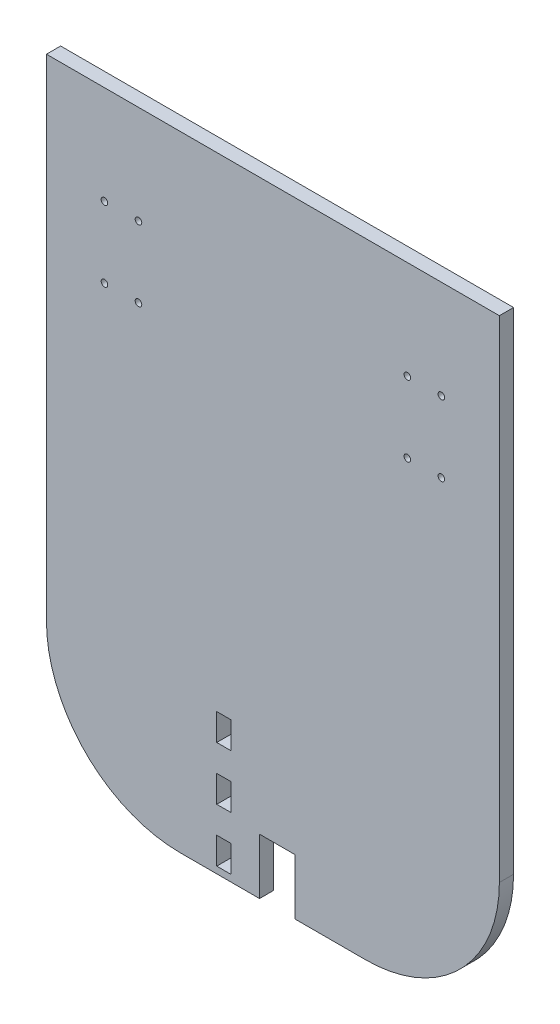
ISO-10303-21;
HEADER;
FILE_DESCRIPTION(('STEP AP214'),'2;1');
FILE_NAME('part.step','',(''),(''),'','','');
FILE_SCHEMA(('AUTOMOTIVE_DESIGN { 1 0 10303 214 1 1 1 1 }'));
ENDSEC;
DATA;
#1=APPLICATION_CONTEXT('core data for automotive mechanical design processes');
#2=APPLICATION_PROTOCOL_DEFINITION('international standard','automotive_design',2000,#1);
#3=PRODUCT_CONTEXT('',#1,'mechanical');
#4=PRODUCT('Part','Part','',(#3));
#5=PRODUCT_RELATED_PRODUCT_CATEGORY('part','',(#4));
#6=PRODUCT_DEFINITION_FORMATION('','',#4);
#7=PRODUCT_DEFINITION_CONTEXT('part definition',#1,'design');
#8=PRODUCT_DEFINITION('design','',#6,#7);
#9=PRODUCT_DEFINITION_SHAPE('','',#8);
#10=(LENGTH_UNIT() NAMED_UNIT(*) SI_UNIT(.MILLI.,.METRE.));
#11=(NAMED_UNIT(*) PLANE_ANGLE_UNIT() SI_UNIT($,.RADIAN.));
#12=(NAMED_UNIT(*) SI_UNIT($,.STERADIAN.) SOLID_ANGLE_UNIT());
#13=UNCERTAINTY_MEASURE_WITH_UNIT(LENGTH_MEASURE(1.E-05),#10,'distance_accuracy_value','');
#14=(GEOMETRIC_REPRESENTATION_CONTEXT(3) GLOBAL_UNCERTAINTY_ASSIGNED_CONTEXT((#13)) GLOBAL_UNIT_ASSIGNED_CONTEXT((#10,
#11,#12)) REPRESENTATION_CONTEXT('',''));
#15=CARTESIAN_POINT('',(0.,0.,0.));
#16=DIRECTION('',(0.,0.,1.));
#17=DIRECTION('',(1.,0.,0.));
#18=AXIS2_PLACEMENT_3D('',#15,#16,#17);
#19=CARTESIAN_POINT('',(-101.5,-140.,6.35));
#20=DIRECTION('',(0.,1.,0.));
#21=DIRECTION('',(0.,0.,1.));
#22=AXIS2_PLACEMENT_3D('',#19,#20,#21);
#23=PLANE('',#22);
#24=DIRECTION('',(1.,0.,0.));
#25=VECTOR('',#24,1.);
#26=CARTESIAN_POINT('',(-101.5,-140.,6.35));
#27=LINE('',#26,#25);
#28=CARTESIAN_POINT('',(-41.5,-140.,6.35));
#29=VERTEX_POINT('',#28);
#30=CARTESIAN_POINT('',(-5.99999999999998,-140.,6.35));
#31=VERTEX_POINT('',#30);
#32=EDGE_CURVE('E388',#29,#31,#27,.T.);
#33=ORIENTED_EDGE('',*,*,#32,.F.);
#34=DIRECTION('',(0.,0.,-1.));
#35=VECTOR('',#34,1.);
#36=CARTESIAN_POINT('',(-41.5,-140.,6.35));
#37=LINE('',#36,#35);
#38=CARTESIAN_POINT('',(-41.5,-140.,0.));
#39=VERTEX_POINT('',#38);
#40=EDGE_CURVE('E46',#29,#39,#37,.T.);
#41=ORIENTED_EDGE('',*,*,#40,.T.);
#42=DIRECTION('',(1.,0.,0.));
#43=VECTOR('',#42,1.);
#44=CARTESIAN_POINT('',(-101.5,-140.,0.));
#45=LINE('',#44,#43);
#46=CARTESIAN_POINT('',(-5.99999999999998,-140.,0.));
#47=VERTEX_POINT('',#46);
#48=EDGE_CURVE('E375',#39,#47,#45,.T.);
#49=ORIENTED_EDGE('',*,*,#48,.T.);
#50=DIRECTION('',(0.,0.,1.));
#51=VECTOR('',#50,1.);
#52=CARTESIAN_POINT('',(-5.99999999999998,-140.,-29.6816441593117));
#53=LINE('',#52,#51);
#54=EDGE_CURVE('E194',#47,#31,#53,.T.);
#55=ORIENTED_EDGE('',*,*,#54,.T.);
#56=EDGE_LOOP('',(#33,#41,#49,#55));
#57=FACE_BOUND('',#56,.T.);
#58=ADVANCED_FACE('F38',(#57),#23,.F.);
#59=CARTESIAN_POINT('',(101.5,-140.,6.35));
#60=DIRECTION('',(-1.,0.,0.));
#61=DIRECTION('',(0.,0.,1.));
#62=AXIS2_PLACEMENT_3D('',#59,#60,#61);
#63=PLANE('',#62);
#64=DIRECTION('',(0.,1.,0.));
#65=VECTOR('',#64,1.);
#66=CARTESIAN_POINT('',(101.5,-140.,6.35));
#67=LINE('',#66,#65);
#68=CARTESIAN_POINT('',(101.5,-80.,6.35));
#69=VERTEX_POINT('',#68);
#70=CARTESIAN_POINT('',(101.5,140.,6.35));
#71=VERTEX_POINT('',#70);
#72=EDGE_CURVE('E370',#69,#71,#67,.T.);
#73=ORIENTED_EDGE('',*,*,#72,.F.);
#74=DIRECTION('',(0.,0.,-1.));
#75=VECTOR('',#74,1.);
#76=CARTESIAN_POINT('',(101.5,-80.,6.35));
#77=LINE('',#76,#75);
#78=CARTESIAN_POINT('',(101.5,-80.,0.));
#79=VERTEX_POINT('',#78);
#80=EDGE_CURVE('E406',#69,#79,#77,.T.);
#81=ORIENTED_EDGE('',*,*,#80,.T.);
#82=DIRECTION('',(0.,1.,0.));
#83=VECTOR('',#82,1.);
#84=CARTESIAN_POINT('',(101.5,-140.,0.));
#85=LINE('',#84,#83);
#86=CARTESIAN_POINT('',(101.5,140.,0.));
#87=VERTEX_POINT('',#86);
#88=EDGE_CURVE('E369',#79,#87,#85,.T.);
#89=ORIENTED_EDGE('',*,*,#88,.T.);
#90=DIRECTION('',(0.,0.,-1.));
#91=VECTOR('',#90,1.);
#92=CARTESIAN_POINT('',(101.5,140.,6.35));
#93=LINE('',#92,#91);
#94=EDGE_CURVE('E403',#71,#87,#93,.T.);
#95=ORIENTED_EDGE('',*,*,#94,.F.);
#96=EDGE_LOOP('',(#73,#81,#89,#95));
#97=FACE_BOUND('',#96,.T.);
#98=ADVANCED_FACE('F435',(#97),#63,.F.);
#99=CARTESIAN_POINT('',(-101.5,140.,6.35));
#100=DIRECTION('',(0.,-1.,0.));
#101=DIRECTION('',(0.,0.,-1.));
#102=AXIS2_PLACEMENT_3D('',#99,#100,#101);
#103=PLANE('',#102);
#104=DIRECTION('',(-1.,0.,0.));
#105=VECTOR('',#104,1.);
#106=CARTESIAN_POINT('',(-101.5,140.,0.));
#107=LINE('',#106,#105);
#108=CARTESIAN_POINT('',(-101.5,140.,0.));
#109=VERTEX_POINT('',#108);
#110=EDGE_CURVE('E395',#87,#109,#107,.T.);
#111=ORIENTED_EDGE('',*,*,#110,.T.);
#112=DIRECTION('',(0.,0.,-1.));
#113=VECTOR('',#112,1.);
#114=CARTESIAN_POINT('',(-101.5,140.,6.35));
#115=LINE('',#114,#113);
#116=CARTESIAN_POINT('',(-101.5,140.,6.35));
#117=VERTEX_POINT('',#116);
#118=EDGE_CURVE('E392',#117,#109,#115,.T.);
#119=ORIENTED_EDGE('',*,*,#118,.F.);
#120=DIRECTION('',(-1.,0.,0.));
#121=VECTOR('',#120,1.);
#122=CARTESIAN_POINT('',(-101.5,140.,6.35));
#123=LINE('',#122,#121);
#124=EDGE_CURVE('E374',#71,#117,#123,.T.);
#125=ORIENTED_EDGE('',*,*,#124,.F.);
#126=ORIENTED_EDGE('',*,*,#94,.T.);
#127=EDGE_LOOP('',(#111,#119,#125,#126));
#128=FACE_BOUND('',#127,.T.);
#129=ADVANCED_FACE('F441',(#128),#103,.F.);
#130=CARTESIAN_POINT('',(-101.5,-140.,6.35));
#131=DIRECTION('',(1.,0.,0.));
#132=DIRECTION('',(0.,0.,-1.));
#133=AXIS2_PLACEMENT_3D('',#130,#131,#132);
#134=PLANE('',#133);
#135=DIRECTION('',(0.,-1.,0.));
#136=VECTOR('',#135,1.);
#137=CARTESIAN_POINT('',(-101.5,-140.,0.));
#138=LINE('',#137,#136);
#139=CARTESIAN_POINT('',(-101.5,-80.,0.));
#140=VERTEX_POINT('',#139);
#141=EDGE_CURVE('E397',#109,#140,#138,.T.);
#142=ORIENTED_EDGE('',*,*,#141,.T.);
#143=DIRECTION('',(0.,0.,-1.));
#144=VECTOR('',#143,1.);
#145=CARTESIAN_POINT('',(-101.5,-80.,6.35));
#146=LINE('',#145,#144);
#147=CARTESIAN_POINT('',(-101.5,-80.,6.35));
#148=VERTEX_POINT('',#147);
#149=EDGE_CURVE('E12',#140,#148,#146,.F.);
#150=ORIENTED_EDGE('',*,*,#149,.T.);
#151=DIRECTION('',(0.,-1.,0.));
#152=VECTOR('',#151,1.);
#153=CARTESIAN_POINT('',(-101.5,-140.,6.35));
#154=LINE('',#153,#152);
#155=EDGE_CURVE('E384',#117,#148,#154,.T.);
#156=ORIENTED_EDGE('',*,*,#155,.F.);
#157=ORIENTED_EDGE('',*,*,#118,.T.);
#158=EDGE_LOOP('',(#142,#150,#156,#157));
#159=FACE_BOUND('',#158,.T.);
#160=ADVANCED_FACE('F425',(#159),#134,.F.);
#161=CARTESIAN_POINT('',(10.,-140.,0.));
#162=VERTEX_POINT('',#161);
#163=CARTESIAN_POINT('',(41.5,-140.,0.));
#164=VERTEX_POINT('',#163);
#165=EDGE_CURVE('E399',#162,#164,#45,.T.);
#166=ORIENTED_EDGE('',*,*,#165,.T.);
#167=DIRECTION('',(0.,0.,-1.));
#168=VECTOR('',#167,1.);
#169=CARTESIAN_POINT('',(41.5,-140.,6.35));
#170=LINE('',#169,#168);
#171=CARTESIAN_POINT('',(41.5,-140.,6.35));
#172=VERTEX_POINT('',#171);
#173=EDGE_CURVE('E413',#164,#172,#170,.F.);
#174=ORIENTED_EDGE('',*,*,#173,.T.);
#175=CARTESIAN_POINT('',(10.,-140.,6.35));
#176=VERTEX_POINT('',#175);
#177=EDGE_CURVE('E387',#176,#172,#27,.T.);
#178=ORIENTED_EDGE('',*,*,#177,.F.);
#179=DIRECTION('',(0.,0.,1.));
#180=VECTOR('',#179,1.);
#181=CARTESIAN_POINT('',(10.,-140.,-29.6816441593117));
#182=LINE('',#181,#180);
#183=EDGE_CURVE('E222',#162,#176,#182,.T.);
#184=ORIENTED_EDGE('',*,*,#183,.F.);
#185=EDGE_LOOP('',(#166,#174,#178,#184));
#186=FACE_BOUND('',#185,.T.);
#187=ADVANCED_FACE('F437',(#186),#23,.F.);
#188=CARTESIAN_POINT('',(101.5,140.,6.35));
#189=DIRECTION('',(0.,0.,-1.));
#190=DIRECTION('',(-1.,0.,0.));
#191=AXIS2_PLACEMENT_3D('',#188,#189,#190);
#192=PLANE('',#191);
#193=DIRECTION('',(0.,-1.,0.));
#194=VECTOR('',#193,1.);
#195=CARTESIAN_POINT('',(-25.175,-77.,6.35));
#196=LINE('',#195,#194);
#197=CARTESIAN_POINT('',(-25.175,-77.,6.35));
#198=VERTEX_POINT('',#197);
#199=CARTESIAN_POINT('',(-25.175,-89.,6.35));
#200=VERTEX_POINT('',#199);
#201=EDGE_CURVE('E233',#198,#200,#196,.T.);
#202=ORIENTED_EDGE('',*,*,#201,.F.);
#203=DIRECTION('',(-1.,0.,0.));
#204=VECTOR('',#203,1.);
#205=CARTESIAN_POINT('',(-25.175,-77.,6.35));
#206=LINE('',#205,#204);
#207=CARTESIAN_POINT('',(-18.825,-77.,6.35));
#208=VERTEX_POINT('',#207);
#209=EDGE_CURVE('E478',#208,#198,#206,.T.);
#210=ORIENTED_EDGE('',*,*,#209,.F.);
#211=DIRECTION('',(0.,1.,0.));
#212=VECTOR('',#211,1.);
#213=CARTESIAN_POINT('',(-18.825,-77.,6.35));
#214=LINE('',#213,#212);
#215=CARTESIAN_POINT('',(-18.825,-89.,6.35));
#216=VERTEX_POINT('',#215);
#217=EDGE_CURVE('E227',#216,#208,#214,.T.);
#218=ORIENTED_EDGE('',*,*,#217,.F.);
#219=DIRECTION('',(1.,0.,0.));
#220=VECTOR('',#219,1.);
#221=CARTESIAN_POINT('',(-25.175,-89.,6.35));
#222=LINE('',#221,#220);
#223=EDGE_CURVE('E228',#200,#216,#222,.T.);
#224=ORIENTED_EDGE('',*,*,#223,.F.);
#225=EDGE_LOOP('',(#202,#210,#218,#224));
#226=FACE_BOUND('',#225,.T.);
#227=DIRECTION('',(0.,-1.,0.));
#228=VECTOR('',#227,1.);
#229=CARTESIAN_POINT('',(-25.175,-101.,6.35));
#230=LINE('',#229,#228);
#231=CARTESIAN_POINT('',(-25.175,-101.,6.35));
#232=VERTEX_POINT('',#231);
#233=CARTESIAN_POINT('',(-25.175,-113.,6.35));
#234=VERTEX_POINT('',#233);
#235=EDGE_CURVE('E245',#232,#234,#230,.T.);
#236=ORIENTED_EDGE('',*,*,#235,.F.);
#237=DIRECTION('',(-1.,0.,0.));
#238=VECTOR('',#237,1.);
#239=CARTESIAN_POINT('',(-25.175,-101.,6.35));
#240=LINE('',#239,#238);
#241=CARTESIAN_POINT('',(-18.825,-101.,6.35));
#242=VERTEX_POINT('',#241);
#243=EDGE_CURVE('E251',#242,#232,#240,.T.);
#244=ORIENTED_EDGE('',*,*,#243,.F.);
#245=DIRECTION('',(0.,1.,0.));
#246=VECTOR('',#245,1.);
#247=CARTESIAN_POINT('',(-18.825,-101.,6.35));
#248=LINE('',#247,#246);
#249=CARTESIAN_POINT('',(-18.825,-113.,6.35));
#250=VERTEX_POINT('',#249);
#251=EDGE_CURVE('E258',#250,#242,#248,.T.);
#252=ORIENTED_EDGE('',*,*,#251,.F.);
#253=DIRECTION('',(1.,0.,0.));
#254=VECTOR('',#253,1.);
#255=CARTESIAN_POINT('',(-25.175,-113.,6.35));
#256=LINE('',#255,#254);
#257=EDGE_CURVE('E250',#234,#250,#256,.T.);
#258=ORIENTED_EDGE('',*,*,#257,.F.);
#259=EDGE_LOOP('',(#236,#244,#252,#258));
#260=FACE_BOUND('',#259,.T.);
#261=DIRECTION('',(0.,1.,0.));
#262=VECTOR('',#261,1.);
#263=CARTESIAN_POINT('',(-18.825,-125.,6.35));
#264=LINE('',#263,#262);
#265=CARTESIAN_POINT('',(-18.825,-137.,6.35));
#266=VERTEX_POINT('',#265);
#267=CARTESIAN_POINT('',(-18.825,-125.,6.35));
#268=VERTEX_POINT('',#267);
#269=EDGE_CURVE('E272',#266,#268,#264,.T.);
#270=ORIENTED_EDGE('',*,*,#269,.F.);
#271=DIRECTION('',(1.,0.,0.));
#272=VECTOR('',#271,1.);
#273=CARTESIAN_POINT('',(-18.825,-137.,6.35));
#274=LINE('',#273,#272);
#275=CARTESIAN_POINT('',(-25.175,-137.,6.35));
#276=VERTEX_POINT('',#275);
#277=EDGE_CURVE('E278',#276,#266,#274,.T.);
#278=ORIENTED_EDGE('',*,*,#277,.F.);
#279=DIRECTION('',(0.,-1.,0.));
#280=VECTOR('',#279,1.);
#281=CARTESIAN_POINT('',(-25.175,-125.,6.35));
#282=LINE('',#281,#280);
#283=CARTESIAN_POINT('',(-25.175,-125.,6.35));
#284=VERTEX_POINT('',#283);
#285=EDGE_CURVE('E285',#284,#276,#282,.T.);
#286=ORIENTED_EDGE('',*,*,#285,.F.);
#287=DIRECTION('',(-1.,0.,0.));
#288=VECTOR('',#287,1.);
#289=CARTESIAN_POINT('',(-18.825,-125.,6.35));
#290=LINE('',#289,#288);
#291=EDGE_CURVE('E277',#268,#284,#290,.T.);
#292=ORIENTED_EDGE('',*,*,#291,.F.);
#293=EDGE_LOOP('',(#270,#278,#286,#292));
#294=FACE_BOUND('',#293,.T.);
#295=CARTESIAN_POINT('',(-60.26,95.875,6.35));
#296=DIRECTION('',(0.,0.,1.));
#297=DIRECTION('',(-1.,0.,0.));
#298=AXIS2_PLACEMENT_3D('',#295,#296,#297);
#299=CIRCLE('',#298,1.475);
#300=CARTESIAN_POINT('',(-61.735,95.875,6.35));
#301=VERTEX_POINT('',#300);
#302=EDGE_CURVE('E299',#301,#301,#299,.T.);
#303=ORIENTED_EDGE('',*,*,#302,.F.);
#304=EDGE_LOOP('',(#303));
#305=FACE_BOUND('',#304,.T.);
#306=CARTESIAN_POINT('',(-75.5,95.875,6.35));
#307=DIRECTION('',(0.,0.,1.));
#308=DIRECTION('',(-1.,0.,0.));
#309=AXIS2_PLACEMENT_3D('',#306,#307,#308);
#310=CIRCLE('',#309,1.475);
#311=CARTESIAN_POINT('',(-76.975,95.875,6.35));
#312=VERTEX_POINT('',#311);
#313=EDGE_CURVE('E309',#312,#312,#310,.T.);
#314=ORIENTED_EDGE('',*,*,#313,.F.);
#315=EDGE_LOOP('',(#314));
#316=FACE_BOUND('',#315,.T.);
#317=CARTESIAN_POINT('',(-60.26,64.125,6.35));
#318=DIRECTION('',(0.,0.,1.));
#319=DIRECTION('',(-1.,0.,0.));
#320=AXIS2_PLACEMENT_3D('',#317,#318,#319);
#321=CIRCLE('',#320,1.475);
#322=CARTESIAN_POINT('',(-61.735,64.125,6.35));
#323=VERTEX_POINT('',#322);
#324=EDGE_CURVE('E317',#323,#323,#321,.T.);
#325=ORIENTED_EDGE('',*,*,#324,.F.);
#326=EDGE_LOOP('',(#325));
#327=FACE_BOUND('',#326,.T.);
#328=CARTESIAN_POINT('',(-75.5,64.125,6.35));
#329=DIRECTION('',(0.,0.,1.));
#330=DIRECTION('',(-1.,0.,0.));
#331=AXIS2_PLACEMENT_3D('',#328,#329,#330);
#332=CIRCLE('',#331,1.475);
#333=CARTESIAN_POINT('',(-76.975,64.125,6.35));
#334=VERTEX_POINT('',#333);
#335=EDGE_CURVE('E328',#334,#334,#332,.T.);
#336=ORIENTED_EDGE('',*,*,#335,.F.);
#337=EDGE_LOOP('',(#336));
#338=FACE_BOUND('',#337,.T.);
#339=CARTESIAN_POINT('',(75.5,64.125,6.35));
#340=DIRECTION('',(0.,0.,1.));
#341=DIRECTION('',(1.,0.,0.));
#342=AXIS2_PLACEMENT_3D('',#339,#340,#341);
#343=CIRCLE('',#342,1.475);
#344=CARTESIAN_POINT('',(76.975,64.125,6.35));
#345=VERTEX_POINT('',#344);
#346=EDGE_CURVE('E335',#345,#345,#343,.T.);
#347=ORIENTED_EDGE('',*,*,#346,.F.);
#348=EDGE_LOOP('',(#347));
#349=FACE_BOUND('',#348,.T.);
#350=CARTESIAN_POINT('',(60.26,64.125,6.35));
#351=DIRECTION('',(0.,0.,1.));
#352=DIRECTION('',(1.,0.,0.));
#353=AXIS2_PLACEMENT_3D('',#350,#351,#352);
#354=CIRCLE('',#353,1.475);
#355=CARTESIAN_POINT('',(61.735,64.125,6.35));
#356=VERTEX_POINT('',#355);
#357=EDGE_CURVE('E343',#356,#356,#354,.T.);
#358=ORIENTED_EDGE('',*,*,#357,.F.);
#359=EDGE_LOOP('',(#358));
#360=FACE_BOUND('',#359,.T.);
#361=CARTESIAN_POINT('',(75.5,95.875,6.35));
#362=DIRECTION('',(0.,0.,1.));
#363=DIRECTION('',(1.,0.,0.));
#364=AXIS2_PLACEMENT_3D('',#361,#362,#363);
#365=CIRCLE('',#364,1.475);
#366=CARTESIAN_POINT('',(76.975,95.875,6.35));
#367=VERTEX_POINT('',#366);
#368=EDGE_CURVE('E354',#367,#367,#365,.T.);
#369=ORIENTED_EDGE('',*,*,#368,.F.);
#370=EDGE_LOOP('',(#369));
#371=FACE_BOUND('',#370,.T.);
#372=CARTESIAN_POINT('',(60.26,95.875,6.35));
#373=DIRECTION('',(0.,0.,1.));
#374=DIRECTION('',(1.,0.,0.));
#375=AXIS2_PLACEMENT_3D('',#372,#373,#374);
#376=CIRCLE('',#375,1.475);
#377=CARTESIAN_POINT('',(61.735,95.875,6.35));
#378=VERTEX_POINT('',#377);
#379=EDGE_CURVE('E361',#378,#378,#376,.T.);
#380=ORIENTED_EDGE('',*,*,#379,.F.);
#381=EDGE_LOOP('',(#380));
#382=FACE_BOUND('',#381,.T.);
#383=ORIENTED_EDGE('',*,*,#177,.T.);
#384=CARTESIAN_POINT('',(41.5,-80.,6.35));
#385=DIRECTION('',(0.,0.,-1.));
#386=DIRECTION('',(-1.,0.,0.));
#387=AXIS2_PLACEMENT_3D('',#384,#385,#386);
#388=CIRCLE('',#387,60.);
#389=EDGE_CURVE('E417',#172,#69,#388,.F.);
#390=ORIENTED_EDGE('',*,*,#389,.T.);
#391=ORIENTED_EDGE('',*,*,#72,.T.);
#392=ORIENTED_EDGE('',*,*,#124,.T.);
#393=ORIENTED_EDGE('',*,*,#155,.T.);
#394=CARTESIAN_POINT('',(-41.5,-80.,6.35));
#395=DIRECTION('',(0.,0.,-1.));
#396=DIRECTION('',(-1.,0.,0.));
#397=AXIS2_PLACEMENT_3D('',#394,#395,#396);
#398=CIRCLE('',#397,60.);
#399=EDGE_CURVE('E58',#148,#29,#398,.F.);
#400=ORIENTED_EDGE('',*,*,#399,.T.);
#401=ORIENTED_EDGE('',*,*,#32,.T.);
#402=DIRECTION('',(0.,-1.,0.));
#403=VECTOR('',#402,1.);
#404=CARTESIAN_POINT('',(-5.99999999999999,-115.,6.35));
#405=LINE('',#404,#403);
#406=CARTESIAN_POINT('',(-5.99999999999999,-115.,6.35));
#407=VERTEX_POINT('',#406);
#408=EDGE_CURVE('E213',#407,#31,#405,.T.);
#409=ORIENTED_EDGE('',*,*,#408,.F.);
#410=DIRECTION('',(-1.,0.,0.));
#411=VECTOR('',#410,1.);
#412=CARTESIAN_POINT('',(-5.99999999999999,-115.,6.35));
#413=LINE('',#412,#411);
#414=CARTESIAN_POINT('',(10.,-115.,6.35));
#415=VERTEX_POINT('',#414);
#416=EDGE_CURVE('E205',#415,#407,#413,.T.);
#417=ORIENTED_EDGE('',*,*,#416,.F.);
#418=DIRECTION('',(0.,1.,0.));
#419=VECTOR('',#418,1.);
#420=CARTESIAN_POINT('',(10.,-115.,6.35));
#421=LINE('',#420,#419);
#422=EDGE_CURVE('E218',#176,#415,#421,.T.);
#423=ORIENTED_EDGE('',*,*,#422,.F.);
#424=EDGE_LOOP('',(#383,#390,#391,#392,#393,#400,#401,#409,#417,#423));
#425=FACE_BOUND('',#424,.T.);
#426=ADVANCED_FACE('F447',(#226,#260,#294,#305,#316,#327,#338,#349,#360,#371,#382,#425),#192,.F.);
#427=CARTESIAN_POINT('',(101.5,140.,0.));
#428=DIRECTION('',(0.,0.,-1.));
#429=DIRECTION('',(-1.,0.,0.));
#430=AXIS2_PLACEMENT_3D('',#427,#428,#429);
#431=PLANE('',#430);
#432=ORIENTED_EDGE('',*,*,#88,.F.);
#433=CARTESIAN_POINT('',(41.5,-80.,0.));
#434=DIRECTION('',(0.,0.,-1.));
#435=DIRECTION('',(-1.,0.,0.));
#436=AXIS2_PLACEMENT_3D('',#433,#434,#435);
#437=CIRCLE('',#436,60.);
#438=EDGE_CURVE('E411',#79,#164,#437,.T.);
#439=ORIENTED_EDGE('',*,*,#438,.T.);
#440=ORIENTED_EDGE('',*,*,#165,.F.);
#441=DIRECTION('',(0.,1.,0.));
#442=VECTOR('',#441,1.);
#443=CARTESIAN_POINT('',(10.,-115.,0.));
#444=LINE('',#443,#442);
#445=CARTESIAN_POINT('',(10.,-115.,0.));
#446=VERTEX_POINT('',#445);
#447=EDGE_CURVE('E212',#162,#446,#444,.T.);
#448=ORIENTED_EDGE('',*,*,#447,.T.);
#449=DIRECTION('',(-1.,0.,0.));
#450=VECTOR('',#449,1.);
#451=CARTESIAN_POINT('',(-5.99999999999999,-115.,0.));
#452=LINE('',#451,#450);
#453=CARTESIAN_POINT('',(-5.99999999999999,-115.,0.));
#454=VERTEX_POINT('',#453);
#455=EDGE_CURVE('E202',#446,#454,#452,.T.);
#456=ORIENTED_EDGE('',*,*,#455,.T.);
#457=DIRECTION('',(0.,-1.,0.));
#458=VECTOR('',#457,1.);
#459=CARTESIAN_POINT('',(-5.99999999999999,-115.,0.));
#460=LINE('',#459,#458);
#461=EDGE_CURVE('E187',#454,#47,#460,.T.);
#462=ORIENTED_EDGE('',*,*,#461,.T.);
#463=ORIENTED_EDGE('',*,*,#48,.F.);
#464=CARTESIAN_POINT('',(-41.5,-80.,0.));
#465=DIRECTION('',(0.,0.,-1.));
#466=DIRECTION('',(-1.,0.,0.));
#467=AXIS2_PLACEMENT_3D('',#464,#465,#466);
#468=CIRCLE('',#467,60.);
#469=EDGE_CURVE('E409',#39,#140,#468,.T.);
#470=ORIENTED_EDGE('',*,*,#469,.T.);
#471=ORIENTED_EDGE('',*,*,#141,.F.);
#472=ORIENTED_EDGE('',*,*,#110,.F.);
#473=EDGE_LOOP('',(#432,#439,#440,#448,#456,#462,#463,#470,#471,#472));
#474=FACE_BOUND('',#473,.T.);
#475=DIRECTION('',(-1.,0.,0.));
#476=VECTOR('',#475,1.);
#477=CARTESIAN_POINT('',(-25.175,-77.,0.));
#478=LINE('',#477,#476);
#479=CARTESIAN_POINT('',(-18.825,-77.,0.));
#480=VERTEX_POINT('',#479);
#481=CARTESIAN_POINT('',(-25.175,-77.,0.));
#482=VERTEX_POINT('',#481);
#483=EDGE_CURVE('E232',#480,#482,#478,.T.);
#484=ORIENTED_EDGE('',*,*,#483,.T.);
#485=DIRECTION('',(0.,-1.,0.));
#486=VECTOR('',#485,1.);
#487=CARTESIAN_POINT('',(-25.175,-77.,0.));
#488=LINE('',#487,#486);
#489=CARTESIAN_POINT('',(-25.175,-89.,0.));
#490=VERTEX_POINT('',#489);
#491=EDGE_CURVE('E510',#482,#490,#488,.T.);
#492=ORIENTED_EDGE('',*,*,#491,.T.);
#493=DIRECTION('',(1.,0.,0.));
#494=VECTOR('',#493,1.);
#495=CARTESIAN_POINT('',(-25.175,-89.,0.));
#496=LINE('',#495,#494);
#497=CARTESIAN_POINT('',(-18.825,-89.,0.));
#498=VERTEX_POINT('',#497);
#499=EDGE_CURVE('E504',#490,#498,#496,.T.);
#500=ORIENTED_EDGE('',*,*,#499,.T.);
#501=DIRECTION('',(0.,1.,0.));
#502=VECTOR('',#501,1.);
#503=CARTESIAN_POINT('',(-18.825,-77.,0.));
#504=LINE('',#503,#502);
#505=EDGE_CURVE('E503',#498,#480,#504,.T.);
#506=ORIENTED_EDGE('',*,*,#505,.T.);
#507=EDGE_LOOP('',(#484,#492,#500,#506));
#508=FACE_BOUND('',#507,.T.);
#509=DIRECTION('',(-1.,0.,0.));
#510=VECTOR('',#509,1.);
#511=CARTESIAN_POINT('',(-25.175,-101.,0.));
#512=LINE('',#511,#510);
#513=CARTESIAN_POINT('',(-18.825,-101.,0.));
#514=VERTEX_POINT('',#513);
#515=CARTESIAN_POINT('',(-25.175,-101.,0.));
#516=VERTEX_POINT('',#515);
#517=EDGE_CURVE('E264',#514,#516,#512,.T.);
#518=ORIENTED_EDGE('',*,*,#517,.T.);
#519=DIRECTION('',(0.,-1.,0.));
#520=VECTOR('',#519,1.);
#521=CARTESIAN_POINT('',(-25.175,-101.,0.));
#522=LINE('',#521,#520);
#523=CARTESIAN_POINT('',(-25.175,-113.,0.));
#524=VERTEX_POINT('',#523);
#525=EDGE_CURVE('E829',#516,#524,#522,.T.);
#526=ORIENTED_EDGE('',*,*,#525,.T.);
#527=DIRECTION('',(1.,0.,0.));
#528=VECTOR('',#527,1.);
#529=CARTESIAN_POINT('',(-25.175,-113.,0.));
#530=LINE('',#529,#528);
#531=CARTESIAN_POINT('',(-18.825,-113.,0.));
#532=VERTEX_POINT('',#531);
#533=EDGE_CURVE('E820',#524,#532,#530,.T.);
#534=ORIENTED_EDGE('',*,*,#533,.T.);
#535=DIRECTION('',(0.,1.,0.));
#536=VECTOR('',#535,1.);
#537=CARTESIAN_POINT('',(-18.825,-101.,0.));
#538=LINE('',#537,#536);
#539=EDGE_CURVE('E818',#532,#514,#538,.T.);
#540=ORIENTED_EDGE('',*,*,#539,.T.);
#541=EDGE_LOOP('',(#518,#526,#534,#540));
#542=FACE_BOUND('',#541,.T.);
#543=DIRECTION('',(1.,0.,0.));
#544=VECTOR('',#543,1.);
#545=CARTESIAN_POINT('',(-18.825,-137.,0.));
#546=LINE('',#545,#544);
#547=CARTESIAN_POINT('',(-25.175,-137.,0.));
#548=VERTEX_POINT('',#547);
#549=CARTESIAN_POINT('',(-18.825,-137.,0.));
#550=VERTEX_POINT('',#549);
#551=EDGE_CURVE('E291',#548,#550,#546,.T.);
#552=ORIENTED_EDGE('',*,*,#551,.T.);
#553=DIRECTION('',(0.,1.,0.));
#554=VECTOR('',#553,1.);
#555=CARTESIAN_POINT('',(-18.825,-125.,0.));
#556=LINE('',#555,#554);
#557=CARTESIAN_POINT('',(-18.825,-125.,0.));
#558=VERTEX_POINT('',#557);
#559=EDGE_CURVE('E865',#550,#558,#556,.T.);
#560=ORIENTED_EDGE('',*,*,#559,.T.);
#561=DIRECTION('',(-1.,0.,0.));
#562=VECTOR('',#561,1.);
#563=CARTESIAN_POINT('',(-18.825,-125.,0.));
#564=LINE('',#563,#562);
#565=CARTESIAN_POINT('',(-25.175,-125.,0.));
#566=VERTEX_POINT('',#565);
#567=EDGE_CURVE('E871',#558,#566,#564,.T.);
#568=ORIENTED_EDGE('',*,*,#567,.T.);
#569=DIRECTION('',(0.,-1.,0.));
#570=VECTOR('',#569,1.);
#571=CARTESIAN_POINT('',(-25.175,-125.,0.));
#572=LINE('',#571,#570);
#573=EDGE_CURVE('E866',#566,#548,#572,.T.);
#574=ORIENTED_EDGE('',*,*,#573,.T.);
#575=EDGE_LOOP('',(#552,#560,#568,#574));
#576=FACE_BOUND('',#575,.T.);
#577=CARTESIAN_POINT('',(-60.26,95.875,0.));
#578=DIRECTION('',(0.,0.,-1.));
#579=DIRECTION('',(-1.,0.,0.));
#580=AXIS2_PLACEMENT_3D('',#577,#578,#579);
#581=CIRCLE('',#580,1.475);
#582=CARTESIAN_POINT('',(-61.735,95.875,0.));
#583=VERTEX_POINT('',#582);
#584=EDGE_CURVE('E305',#583,#583,#581,.F.);
#585=ORIENTED_EDGE('',*,*,#584,.T.);
#586=EDGE_LOOP('',(#585));
#587=FACE_BOUND('',#586,.T.);
#588=CARTESIAN_POINT('',(-75.5,95.875,0.));
#589=DIRECTION('',(0.,0.,-1.));
#590=DIRECTION('',(-1.,0.,0.));
#591=AXIS2_PLACEMENT_3D('',#588,#589,#590);
#592=CIRCLE('',#591,1.475);
#593=CARTESIAN_POINT('',(-76.975,95.875,0.));
#594=VERTEX_POINT('',#593);
#595=EDGE_CURVE('E314',#594,#594,#592,.F.);
#596=ORIENTED_EDGE('',*,*,#595,.T.);
#597=EDGE_LOOP('',(#596));
#598=FACE_BOUND('',#597,.T.);
#599=CARTESIAN_POINT('',(-60.26,64.125,0.));
#600=DIRECTION('',(0.,0.,-1.));
#601=DIRECTION('',(-1.,0.,0.));
#602=AXIS2_PLACEMENT_3D('',#599,#600,#601);
#603=CIRCLE('',#602,1.475);
#604=CARTESIAN_POINT('',(-61.735,64.125,0.));
#605=VERTEX_POINT('',#604);
#606=EDGE_CURVE('E322',#605,#605,#603,.F.);
#607=ORIENTED_EDGE('',*,*,#606,.T.);
#608=EDGE_LOOP('',(#607));
#609=FACE_BOUND('',#608,.T.);
#610=CARTESIAN_POINT('',(-75.5,64.125,0.));
#611=DIRECTION('',(0.,0.,-1.));
#612=DIRECTION('',(-1.,0.,0.));
#613=AXIS2_PLACEMENT_3D('',#610,#611,#612);
#614=CIRCLE('',#613,1.475);
#615=CARTESIAN_POINT('',(-76.975,64.125,0.));
#616=VERTEX_POINT('',#615);
#617=EDGE_CURVE('E333',#616,#616,#614,.F.);
#618=ORIENTED_EDGE('',*,*,#617,.T.);
#619=EDGE_LOOP('',(#618));
#620=FACE_BOUND('',#619,.T.);
#621=CARTESIAN_POINT('',(75.5,64.125,0.));
#622=DIRECTION('',(0.,0.,-1.));
#623=DIRECTION('',(-1.,0.,0.));
#624=AXIS2_PLACEMENT_3D('',#621,#622,#623);
#625=CIRCLE('',#624,1.475);
#626=CARTESIAN_POINT('',(74.025,64.125,0.));
#627=VERTEX_POINT('',#626);
#628=EDGE_CURVE('E340',#627,#627,#625,.F.);
#629=ORIENTED_EDGE('',*,*,#628,.T.);
#630=EDGE_LOOP('',(#629));
#631=FACE_BOUND('',#630,.T.);
#632=CARTESIAN_POINT('',(60.26,64.125,0.));
#633=DIRECTION('',(0.,0.,-1.));
#634=DIRECTION('',(-1.,0.,0.));
#635=AXIS2_PLACEMENT_3D('',#632,#633,#634);
#636=CIRCLE('',#635,1.475);
#637=CARTESIAN_POINT('',(58.785,64.125,0.));
#638=VERTEX_POINT('',#637);
#639=EDGE_CURVE('E348',#638,#638,#636,.F.);
#640=ORIENTED_EDGE('',*,*,#639,.T.);
#641=EDGE_LOOP('',(#640));
#642=FACE_BOUND('',#641,.T.);
#643=CARTESIAN_POINT('',(75.5,95.875,0.));
#644=DIRECTION('',(0.,0.,-1.));
#645=DIRECTION('',(-1.,0.,0.));
#646=AXIS2_PLACEMENT_3D('',#643,#644,#645);
#647=CIRCLE('',#646,1.475);
#648=CARTESIAN_POINT('',(74.025,95.875,0.));
#649=VERTEX_POINT('',#648);
#650=EDGE_CURVE('E359',#649,#649,#647,.F.);
#651=ORIENTED_EDGE('',*,*,#650,.T.);
#652=EDGE_LOOP('',(#651));
#653=FACE_BOUND('',#652,.T.);
#654=CARTESIAN_POINT('',(60.26,95.875,0.));
#655=DIRECTION('',(0.,0.,-1.));
#656=DIRECTION('',(-1.,0.,0.));
#657=AXIS2_PLACEMENT_3D('',#654,#655,#656);
#658=CIRCLE('',#657,1.475);
#659=CARTESIAN_POINT('',(58.785,95.875,0.));
#660=VERTEX_POINT('',#659);
#661=EDGE_CURVE('E366',#660,#660,#658,.F.);
#662=ORIENTED_EDGE('',*,*,#661,.T.);
#663=EDGE_LOOP('',(#662));
#664=FACE_BOUND('',#663,.T.);
#665=ADVANCED_FACE('F209',(#474,#508,#542,#576,#587,#598,#609,#620,#631,#642,#653,#664),#431,.T.);
#666=CARTESIAN_POINT('',(60.26,95.875,-4.17193000900064));
#667=DIRECTION('',(0.,0.,1.));
#668=DIRECTION('',(1.,0.,0.));
#669=AXIS2_PLACEMENT_3D('',#666,#667,#668);
#670=CYLINDRICAL_SURFACE('',#669,1.475);
#671=ORIENTED_EDGE('',*,*,#379,.T.);
#672=EDGE_LOOP('',(#671));
#673=FACE_BOUND('',#672,.T.);
#674=ORIENTED_EDGE('',*,*,#661,.F.);
#675=EDGE_LOOP('',(#674));
#676=FACE_BOUND('',#675,.T.);
#677=ADVANCED_FACE('F519',(#673,#676),#670,.F.);
#678=CARTESIAN_POINT('',(75.5,95.875,-4.17193000900064));
#679=DIRECTION('',(0.,0.,1.));
#680=DIRECTION('',(1.,0.,0.));
#681=AXIS2_PLACEMENT_3D('',#678,#679,#680);
#682=CYLINDRICAL_SURFACE('',#681,1.475);
#683=ORIENTED_EDGE('',*,*,#368,.T.);
#684=EDGE_LOOP('',(#683));
#685=FACE_BOUND('',#684,.T.);
#686=ORIENTED_EDGE('',*,*,#650,.F.);
#687=EDGE_LOOP('',(#686));
#688=FACE_BOUND('',#687,.T.);
#689=ADVANCED_FACE('F549',(#685,#688),#682,.F.);
#690=CARTESIAN_POINT('',(60.26,64.125,-4.17193000900064));
#691=DIRECTION('',(0.,0.,1.));
#692=DIRECTION('',(1.,0.,0.));
#693=AXIS2_PLACEMENT_3D('',#690,#691,#692);
#694=CYLINDRICAL_SURFACE('',#693,1.475);
#695=ORIENTED_EDGE('',*,*,#357,.T.);
#696=EDGE_LOOP('',(#695));
#697=FACE_BOUND('',#696,.T.);
#698=ORIENTED_EDGE('',*,*,#639,.F.);
#699=EDGE_LOOP('',(#698));
#700=FACE_BOUND('',#699,.T.);
#701=ADVANCED_FACE('F555',(#697,#700),#694,.F.);
#702=CARTESIAN_POINT('',(75.5,64.125,-4.17193000900064));
#703=DIRECTION('',(0.,0.,1.));
#704=DIRECTION('',(1.,0.,0.));
#705=AXIS2_PLACEMENT_3D('',#702,#703,#704);
#706=CYLINDRICAL_SURFACE('',#705,1.475);
#707=ORIENTED_EDGE('',*,*,#346,.T.);
#708=EDGE_LOOP('',(#707));
#709=FACE_BOUND('',#708,.T.);
#710=ORIENTED_EDGE('',*,*,#628,.F.);
#711=EDGE_LOOP('',(#710));
#712=FACE_BOUND('',#711,.T.);
#713=ADVANCED_FACE('F561',(#709,#712),#706,.F.);
#714=CARTESIAN_POINT('',(-75.5,64.125,-4.17193000900064));
#715=DIRECTION('',(0.,0.,1.));
#716=DIRECTION('',(1.,0.,0.));
#717=AXIS2_PLACEMENT_3D('',#714,#715,#716);
#718=CYLINDRICAL_SURFACE('',#717,1.475);
#719=ORIENTED_EDGE('',*,*,#335,.T.);
#720=EDGE_LOOP('',(#719));
#721=FACE_BOUND('',#720,.T.);
#722=ORIENTED_EDGE('',*,*,#617,.F.);
#723=EDGE_LOOP('',(#722));
#724=FACE_BOUND('',#723,.T.);
#725=ADVANCED_FACE('F565',(#721,#724),#718,.F.);
#726=CARTESIAN_POINT('',(-60.26,64.125,-4.17193000900064));
#727=DIRECTION('',(0.,0.,1.));
#728=DIRECTION('',(1.,0.,0.));
#729=AXIS2_PLACEMENT_3D('',#726,#727,#728);
#730=CYLINDRICAL_SURFACE('',#729,1.475);
#731=ORIENTED_EDGE('',*,*,#324,.T.);
#732=EDGE_LOOP('',(#731));
#733=FACE_BOUND('',#732,.T.);
#734=ORIENTED_EDGE('',*,*,#606,.F.);
#735=EDGE_LOOP('',(#734));
#736=FACE_BOUND('',#735,.T.);
#737=ADVANCED_FACE('F569',(#733,#736),#730,.F.);
#738=CARTESIAN_POINT('',(-75.5,95.875,-4.17193000900064));
#739=DIRECTION('',(0.,0.,1.));
#740=DIRECTION('',(1.,0.,0.));
#741=AXIS2_PLACEMENT_3D('',#738,#739,#740);
#742=CYLINDRICAL_SURFACE('',#741,1.475);
#743=ORIENTED_EDGE('',*,*,#313,.T.);
#744=EDGE_LOOP('',(#743));
#745=FACE_BOUND('',#744,.T.);
#746=ORIENTED_EDGE('',*,*,#595,.F.);
#747=EDGE_LOOP('',(#746));
#748=FACE_BOUND('',#747,.T.);
#749=ADVANCED_FACE('F573',(#745,#748),#742,.F.);
#750=CARTESIAN_POINT('',(-60.26,95.875,-4.17193000900064));
#751=DIRECTION('',(0.,0.,1.));
#752=DIRECTION('',(1.,0.,0.));
#753=AXIS2_PLACEMENT_3D('',#750,#751,#752);
#754=CYLINDRICAL_SURFACE('',#753,1.475);
#755=ORIENTED_EDGE('',*,*,#302,.T.);
#756=EDGE_LOOP('',(#755));
#757=FACE_BOUND('',#756,.T.);
#758=ORIENTED_EDGE('',*,*,#584,.F.);
#759=EDGE_LOOP('',(#758));
#760=FACE_BOUND('',#759,.T.);
#761=ADVANCED_FACE('F577',(#757,#760),#754,.F.);
#762=CARTESIAN_POINT('',(-18.825,-137.,-29.6816441593117));
#763=DIRECTION('',(0.,-1.,0.));
#764=DIRECTION('',(0.,0.,-1.));
#765=AXIS2_PLACEMENT_3D('',#762,#763,#764);
#766=PLANE('',#765);
#767=DIRECTION('',(0.,0.,1.));
#768=VECTOR('',#767,1.);
#769=CARTESIAN_POINT('',(-25.175,-137.,-29.6816441593117));
#770=LINE('',#769,#768);
#771=EDGE_CURVE('E306',#548,#276,#770,.T.);
#772=ORIENTED_EDGE('',*,*,#771,.T.);
#773=ORIENTED_EDGE('',*,*,#277,.T.);
#774=DIRECTION('',(0.,0.,1.));
#775=VECTOR('',#774,1.);
#776=CARTESIAN_POINT('',(-18.825,-137.,-29.6816441593117));
#777=LINE('',#776,#775);
#778=EDGE_CURVE('E864',#550,#266,#777,.T.);
#779=ORIENTED_EDGE('',*,*,#778,.F.);
#780=ORIENTED_EDGE('',*,*,#551,.F.);
#781=EDGE_LOOP('',(#772,#773,#779,#780));
#782=FACE_BOUND('',#781,.T.);
#783=ADVANCED_FACE('F581',(#782),#766,.F.);
#784=CARTESIAN_POINT('',(-18.825,-125.,-29.6816441593117));
#785=DIRECTION('',(1.,0.,0.));
#786=DIRECTION('',(0.,1.,0.));
#787=AXIS2_PLACEMENT_3D('',#784,#785,#786);
#788=PLANE('',#787);
#789=ORIENTED_EDGE('',*,*,#778,.T.);
#790=ORIENTED_EDGE('',*,*,#269,.T.);
#791=DIRECTION('',(0.,0.,1.));
#792=VECTOR('',#791,1.);
#793=CARTESIAN_POINT('',(-18.825,-125.,-29.6816441593117));
#794=LINE('',#793,#792);
#795=EDGE_CURVE('E862',#558,#268,#794,.T.);
#796=ORIENTED_EDGE('',*,*,#795,.F.);
#797=ORIENTED_EDGE('',*,*,#559,.F.);
#798=EDGE_LOOP('',(#789,#790,#796,#797));
#799=FACE_BOUND('',#798,.T.);
#800=ADVANCED_FACE('F585',(#799),#788,.F.);
#801=CARTESIAN_POINT('',(-18.825,-125.,-29.6816441593117));
#802=DIRECTION('',(0.,1.,0.));
#803=DIRECTION('',(-1.,0.,0.));
#804=AXIS2_PLACEMENT_3D('',#801,#802,#803);
#805=PLANE('',#804);
#806=ORIENTED_EDGE('',*,*,#795,.T.);
#807=ORIENTED_EDGE('',*,*,#291,.T.);
#808=DIRECTION('',(0.,0.,1.));
#809=VECTOR('',#808,1.);
#810=CARTESIAN_POINT('',(-25.175,-125.,-29.6816441593117));
#811=LINE('',#810,#809);
#812=EDGE_CURVE('E869',#566,#284,#811,.T.);
#813=ORIENTED_EDGE('',*,*,#812,.F.);
#814=ORIENTED_EDGE('',*,*,#567,.F.);
#815=EDGE_LOOP('',(#806,#807,#813,#814));
#816=FACE_BOUND('',#815,.T.);
#817=ADVANCED_FACE('F589',(#816),#805,.F.);
#818=CARTESIAN_POINT('',(-25.175,-125.,-29.6816441593117));
#819=DIRECTION('',(-1.,0.,0.));
#820=DIRECTION('',(0.,0.,1.));
#821=AXIS2_PLACEMENT_3D('',#818,#819,#820);
#822=PLANE('',#821);
#823=ORIENTED_EDGE('',*,*,#812,.T.);
#824=ORIENTED_EDGE('',*,*,#285,.T.);
#825=ORIENTED_EDGE('',*,*,#771,.F.);
#826=ORIENTED_EDGE('',*,*,#573,.F.);
#827=EDGE_LOOP('',(#823,#824,#825,#826));
#828=FACE_BOUND('',#827,.T.);
#829=ADVANCED_FACE('F593',(#828),#822,.F.);
#830=CARTESIAN_POINT('',(-25.175,-101.,-29.6816441593117));
#831=DIRECTION('',(0.,1.,0.));
#832=DIRECTION('',(0.,0.,1.));
#833=AXIS2_PLACEMENT_3D('',#830,#831,#832);
#834=PLANE('',#833);
#835=DIRECTION('',(0.,0.,1.));
#836=VECTOR('',#835,1.);
#837=CARTESIAN_POINT('',(-18.825,-101.,-29.6816441593117));
#838=LINE('',#837,#836);
#839=EDGE_CURVE('E290',#514,#242,#838,.T.);
#840=ORIENTED_EDGE('',*,*,#839,.T.);
#841=ORIENTED_EDGE('',*,*,#243,.T.);
#842=DIRECTION('',(0.,0.,1.));
#843=VECTOR('',#842,1.);
#844=CARTESIAN_POINT('',(-25.175,-101.,-29.6816441593117));
#845=LINE('',#844,#843);
#846=EDGE_CURVE('E826',#516,#232,#845,.T.);
#847=ORIENTED_EDGE('',*,*,#846,.F.);
#848=ORIENTED_EDGE('',*,*,#517,.F.);
#849=EDGE_LOOP('',(#840,#841,#847,#848));
#850=FACE_BOUND('',#849,.T.);
#851=ADVANCED_FACE('F597',(#850),#834,.F.);
#852=CARTESIAN_POINT('',(-25.175,-101.,-29.6816441593117));
#853=DIRECTION('',(-1.,0.,0.));
#854=DIRECTION('',(0.,0.,1.));
#855=AXIS2_PLACEMENT_3D('',#852,#853,#854);
#856=PLANE('',#855);
#857=ORIENTED_EDGE('',*,*,#846,.T.);
#858=ORIENTED_EDGE('',*,*,#235,.T.);
#859=DIRECTION('',(0.,0.,1.));
#860=VECTOR('',#859,1.);
#861=CARTESIAN_POINT('',(-25.175,-113.,-29.6816441593117));
#862=LINE('',#861,#860);
#863=EDGE_CURVE('E830',#524,#234,#862,.T.);
#864=ORIENTED_EDGE('',*,*,#863,.F.);
#865=ORIENTED_EDGE('',*,*,#525,.F.);
#866=EDGE_LOOP('',(#857,#858,#864,#865));
#867=FACE_BOUND('',#866,.T.);
#868=ADVANCED_FACE('F601',(#867),#856,.F.);
#869=CARTESIAN_POINT('',(-25.175,-113.,-29.6816441593117));
#870=DIRECTION('',(0.,-1.,0.));
#871=DIRECTION('',(0.,0.,-1.));
#872=AXIS2_PLACEMENT_3D('',#869,#870,#871);
#873=PLANE('',#872);
#874=ORIENTED_EDGE('',*,*,#863,.T.);
#875=ORIENTED_EDGE('',*,*,#257,.T.);
#876=DIRECTION('',(0.,0.,1.));
#877=VECTOR('',#876,1.);
#878=CARTESIAN_POINT('',(-18.825,-113.,-29.6816441593117));
#879=LINE('',#878,#877);
#880=EDGE_CURVE('E815',#532,#250,#879,.T.);
#881=ORIENTED_EDGE('',*,*,#880,.F.);
#882=ORIENTED_EDGE('',*,*,#533,.F.);
#883=EDGE_LOOP('',(#874,#875,#881,#882));
#884=FACE_BOUND('',#883,.T.);
#885=ADVANCED_FACE('F605',(#884),#873,.F.);
#886=CARTESIAN_POINT('',(-18.825,-101.,-29.6816441593117));
#887=DIRECTION('',(1.,0.,0.));
#888=DIRECTION('',(0.,0.,-1.));
#889=AXIS2_PLACEMENT_3D('',#886,#887,#888);
#890=PLANE('',#889);
#891=ORIENTED_EDGE('',*,*,#880,.T.);
#892=ORIENTED_EDGE('',*,*,#251,.T.);
#893=ORIENTED_EDGE('',*,*,#839,.F.);
#894=ORIENTED_EDGE('',*,*,#539,.F.);
#895=EDGE_LOOP('',(#891,#892,#893,#894));
#896=FACE_BOUND('',#895,.T.);
#897=ADVANCED_FACE('F609',(#896),#890,.F.);
#898=CARTESIAN_POINT('',(-25.175,-77.,-29.6816441593117));
#899=DIRECTION('',(0.,1.,0.));
#900=DIRECTION('',(0.,0.,1.));
#901=AXIS2_PLACEMENT_3D('',#898,#899,#900);
#902=PLANE('',#901);
#903=DIRECTION('',(0.,0.,1.));
#904=VECTOR('',#903,1.);
#905=CARTESIAN_POINT('',(-18.825,-77.,-29.6816441593117));
#906=LINE('',#905,#904);
#907=EDGE_CURVE('E263',#480,#208,#906,.T.);
#908=ORIENTED_EDGE('',*,*,#907,.T.);
#909=ORIENTED_EDGE('',*,*,#209,.T.);
#910=DIRECTION('',(0.,0.,1.));
#911=VECTOR('',#910,1.);
#912=CARTESIAN_POINT('',(-25.175,-77.,-29.6816441593117));
#913=LINE('',#912,#911);
#914=EDGE_CURVE('E490',#482,#198,#913,.T.);
#915=ORIENTED_EDGE('',*,*,#914,.F.);
#916=ORIENTED_EDGE('',*,*,#483,.F.);
#917=EDGE_LOOP('',(#908,#909,#915,#916));
#918=FACE_BOUND('',#917,.T.);
#919=ADVANCED_FACE('F514',(#918),#902,.F.);
#920=CARTESIAN_POINT('',(-25.175,-77.,-29.6816441593117));
#921=DIRECTION('',(-1.,0.,0.));
#922=DIRECTION('',(0.,0.,1.));
#923=AXIS2_PLACEMENT_3D('',#920,#921,#922);
#924=PLANE('',#923);
#925=ORIENTED_EDGE('',*,*,#914,.T.);
#926=ORIENTED_EDGE('',*,*,#201,.T.);
#927=DIRECTION('',(0.,0.,1.));
#928=VECTOR('',#927,1.);
#929=CARTESIAN_POINT('',(-25.175,-89.,-29.6816441593117));
#930=LINE('',#929,#928);
#931=EDGE_CURVE('E487',#490,#200,#930,.T.);
#932=ORIENTED_EDGE('',*,*,#931,.F.);
#933=ORIENTED_EDGE('',*,*,#491,.F.);
#934=EDGE_LOOP('',(#925,#926,#932,#933));
#935=FACE_BOUND('',#934,.T.);
#936=ADVANCED_FACE('F486',(#935),#924,.F.);
#937=CARTESIAN_POINT('',(-25.175,-89.,-29.6816441593117));
#938=DIRECTION('',(0.,-1.,0.));
#939=DIRECTION('',(0.,0.,-1.));
#940=AXIS2_PLACEMENT_3D('',#937,#938,#939);
#941=PLANE('',#940);
#942=ORIENTED_EDGE('',*,*,#931,.T.);
#943=ORIENTED_EDGE('',*,*,#223,.T.);
#944=DIRECTION('',(0.,0.,1.));
#945=VECTOR('',#944,1.);
#946=CARTESIAN_POINT('',(-18.825,-89.,-29.6816441593117));
#947=LINE('',#946,#945);
#948=EDGE_CURVE('E498',#498,#216,#947,.T.);
#949=ORIENTED_EDGE('',*,*,#948,.F.);
#950=ORIENTED_EDGE('',*,*,#499,.F.);
#951=EDGE_LOOP('',(#942,#943,#949,#950));
#952=FACE_BOUND('',#951,.T.);
#953=ADVANCED_FACE('F497',(#952),#941,.F.);
#954=CARTESIAN_POINT('',(-18.825,-77.,-29.6816441593117));
#955=DIRECTION('',(1.,0.,0.));
#956=DIRECTION('',(0.,0.,-1.));
#957=AXIS2_PLACEMENT_3D('',#954,#955,#956);
#958=PLANE('',#957);
#959=ORIENTED_EDGE('',*,*,#948,.T.);
#960=ORIENTED_EDGE('',*,*,#217,.T.);
#961=ORIENTED_EDGE('',*,*,#907,.F.);
#962=ORIENTED_EDGE('',*,*,#505,.F.);
#963=EDGE_LOOP('',(#959,#960,#961,#962));
#964=FACE_BOUND('',#963,.T.);
#965=ADVANCED_FACE('F501',(#964),#958,.F.);
#966=CARTESIAN_POINT('',(-5.99999999999999,-115.,-29.6816441593117));
#967=DIRECTION('',(0.,1.,0.));
#968=DIRECTION('',(0.,0.,1.));
#969=AXIS2_PLACEMENT_3D('',#966,#967,#968);
#970=PLANE('',#969);
#971=DIRECTION('',(0.,0.,1.));
#972=VECTOR('',#971,1.);
#973=CARTESIAN_POINT('',(10.,-115.,-29.6816441593117));
#974=LINE('',#973,#972);
#975=EDGE_CURVE('E221',#446,#415,#974,.T.);
#976=ORIENTED_EDGE('',*,*,#975,.T.);
#977=ORIENTED_EDGE('',*,*,#416,.T.);
#978=DIRECTION('',(0.,0.,1.));
#979=VECTOR('',#978,1.);
#980=CARTESIAN_POINT('',(-5.99999999999999,-115.,-29.6816441593117));
#981=LINE('',#980,#979);
#982=EDGE_CURVE('E191',#454,#407,#981,.T.);
#983=ORIENTED_EDGE('',*,*,#982,.F.);
#984=ORIENTED_EDGE('',*,*,#455,.F.);
#985=EDGE_LOOP('',(#976,#977,#983,#984));
#986=FACE_BOUND('',#985,.T.);
#987=ADVANCED_FACE('F201',(#986),#970,.F.);
#988=CARTESIAN_POINT('',(-5.99999999999999,-115.,-29.6816441593117));
#989=DIRECTION('',(-1.,0.,0.));
#990=DIRECTION('',(0.,-1.,0.));
#991=AXIS2_PLACEMENT_3D('',#988,#989,#990);
#992=PLANE('',#991);
#993=ORIENTED_EDGE('',*,*,#982,.T.);
#994=ORIENTED_EDGE('',*,*,#408,.T.);
#995=ORIENTED_EDGE('',*,*,#54,.F.);
#996=ORIENTED_EDGE('',*,*,#461,.F.);
#997=EDGE_LOOP('',(#993,#994,#995,#996));
#998=FACE_BOUND('',#997,.T.);
#999=ADVANCED_FACE('F189',(#998),#992,.F.);
#1000=CARTESIAN_POINT('',(10.,-115.,-29.6816441593117));
#1001=DIRECTION('',(1.,0.,0.));
#1002=DIRECTION('',(0.,1.,0.));
#1003=AXIS2_PLACEMENT_3D('',#1000,#1001,#1002);
#1004=PLANE('',#1003);
#1005=ORIENTED_EDGE('',*,*,#183,.T.);
#1006=ORIENTED_EDGE('',*,*,#422,.T.);
#1007=ORIENTED_EDGE('',*,*,#975,.F.);
#1008=ORIENTED_EDGE('',*,*,#447,.F.);
#1009=EDGE_LOOP('',(#1005,#1006,#1007,#1008));
#1010=FACE_BOUND('',#1009,.T.);
#1011=ADVANCED_FACE('F432',(#1010),#1004,.F.);
#1012=CARTESIAN_POINT('',(41.5,-80.,6.35));
#1013=DIRECTION('',(0.,0.,-1.));
#1014=DIRECTION('',(-1.,0.,0.));
#1015=AXIS2_PLACEMENT_3D('',#1012,#1013,#1014);
#1016=CYLINDRICAL_SURFACE('',#1015,60.);
#1017=ORIENTED_EDGE('',*,*,#389,.F.);
#1018=ORIENTED_EDGE('',*,*,#173,.F.);
#1019=ORIENTED_EDGE('',*,*,#438,.F.);
#1020=ORIENTED_EDGE('',*,*,#80,.F.);
#1021=EDGE_LOOP('',(#1017,#1018,#1019,#1020));
#1022=FACE_BOUND('',#1021,.T.);
#1023=ADVANCED_FACE('F428',(#1022),#1016,.T.);
#1024=CARTESIAN_POINT('',(-41.5,-80.,6.35));
#1025=DIRECTION('',(0.,0.,-1.));
#1026=DIRECTION('',(-1.,0.,0.));
#1027=AXIS2_PLACEMENT_3D('',#1024,#1025,#1026);
#1028=CYLINDRICAL_SURFACE('',#1027,60.);
#1029=ORIENTED_EDGE('',*,*,#399,.F.);
#1030=ORIENTED_EDGE('',*,*,#149,.F.);
#1031=ORIENTED_EDGE('',*,*,#469,.F.);
#1032=ORIENTED_EDGE('',*,*,#40,.F.);
#1033=EDGE_LOOP('',(#1029,#1030,#1031,#1032));
#1034=FACE_BOUND('',#1033,.T.);
#1035=ADVANCED_FACE('F40',(#1034),#1028,.T.);
#1036=CLOSED_SHELL('',(#58,#98,#129,#160,#187,#426,#665,#677,#689,#701,#713,#725,#737,#749,#761,
#783,#800,#817,#829,#851,#868,#885,#897,#919,#936,#953,#965,#987,#999,#1011,#1023,#1035));
#1037=MANIFOLD_SOLID_BREP('B2',#1036);
#1038=ADVANCED_BREP_SHAPE_REPRESENTATION('',(#18,#1037),#14);
#1039=SHAPE_DEFINITION_REPRESENTATION(#9,#1038);
ENDSEC;
END-ISO-10303-21;
